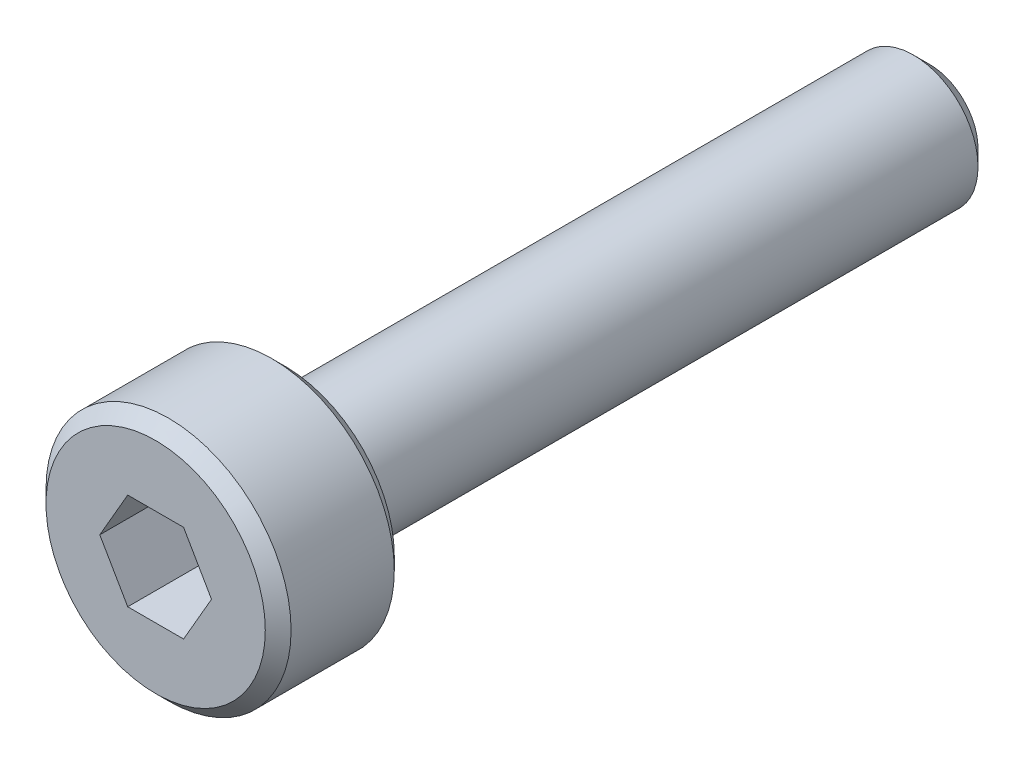
ISO-10303-21;
HEADER;
FILE_DESCRIPTION(('STEP AP214'),'2;1');
FILE_NAME('part.step','',(''),(''),'','','');
FILE_SCHEMA(('AUTOMOTIVE_DESIGN { 1 0 10303 214 1 1 1 1 }'));
ENDSEC;
DATA;
#1=APPLICATION_CONTEXT('core data for automotive mechanical design processes');
#2=APPLICATION_PROTOCOL_DEFINITION('international standard','automotive_design',2000,#1);
#3=PRODUCT_CONTEXT('',#1,'mechanical');
#4=PRODUCT('Part','Part','',(#3));
#5=PRODUCT_RELATED_PRODUCT_CATEGORY('part','',(#4));
#6=PRODUCT_DEFINITION_FORMATION('','',#4);
#7=PRODUCT_DEFINITION_CONTEXT('part definition',#1,'design');
#8=PRODUCT_DEFINITION('design','',#6,#7);
#9=PRODUCT_DEFINITION_SHAPE('','',#8);
#10=(LENGTH_UNIT() NAMED_UNIT(*) SI_UNIT(.MILLI.,.METRE.));
#11=(NAMED_UNIT(*) PLANE_ANGLE_UNIT() SI_UNIT($,.RADIAN.));
#12=(NAMED_UNIT(*) SI_UNIT($,.STERADIAN.) SOLID_ANGLE_UNIT());
#13=UNCERTAINTY_MEASURE_WITH_UNIT(LENGTH_MEASURE(1.E-05),#10,'distance_accuracy_value','');
#14=(GEOMETRIC_REPRESENTATION_CONTEXT(3) GLOBAL_UNCERTAINTY_ASSIGNED_CONTEXT((#13)) GLOBAL_UNIT_ASSIGNED_CONTEXT((#10,
#11,#12)) REPRESENTATION_CONTEXT('',''));
#15=CARTESIAN_POINT('',(0.,0.,0.));
#16=DIRECTION('',(0.,0.,1.));
#17=DIRECTION('',(1.,0.,0.));
#18=AXIS2_PLACEMENT_3D('',#15,#16,#17);
#19=CARTESIAN_POINT('',(0.,0.,0.));
#20=DIRECTION('',(0.,0.,1.));
#21=DIRECTION('',(1.,0.,0.));
#22=AXIS2_PLACEMENT_3D('',#19,#20,#21);
#23=PLANE('',#22);
#24=DIRECTION('',(0.499999999999999,0.866025403784439,0.));
#25=VECTOR('',#24,1.);
#26=CARTESIAN_POINT('',(0.433012701892219,-0.750000000000001,0.));
#27=LINE('',#26,#25);
#28=CARTESIAN_POINT('',(0.433012701892219,-0.750000000000001,0.));
#29=VERTEX_POINT('',#28);
#30=CARTESIAN_POINT('',(0.866025403784439,0.,0.));
#31=VERTEX_POINT('',#30);
#32=EDGE_CURVE('E45',#29,#31,#27,.T.);
#33=ORIENTED_EDGE('',*,*,#32,.F.);
#34=DIRECTION('',(1.,0.,0.));
#35=VECTOR('',#34,1.);
#36=CARTESIAN_POINT('',(-0.433012701892219,-0.750000000000001,0.));
#37=LINE('',#36,#35);
#38=CARTESIAN_POINT('',(-0.433012701892219,-0.750000000000001,0.));
#39=VERTEX_POINT('',#38);
#40=EDGE_CURVE('E128',#39,#29,#37,.T.);
#41=ORIENTED_EDGE('',*,*,#40,.F.);
#42=DIRECTION('',(0.5,-0.866025403784439,0.));
#43=VECTOR('',#42,1.);
#44=CARTESIAN_POINT('',(-0.866025403784439,0.,0.));
#45=LINE('',#44,#43);
#46=CARTESIAN_POINT('',(-0.866025403784439,0.,0.));
#47=VERTEX_POINT('',#46);
#48=EDGE_CURVE('E126',#47,#39,#45,.T.);
#49=ORIENTED_EDGE('',*,*,#48,.F.);
#50=DIRECTION('',(-0.5,-0.866025403784439,0.));
#51=VECTOR('',#50,1.);
#52=CARTESIAN_POINT('',(-0.43301270189222,0.75,0.));
#53=LINE('',#52,#51);
#54=CARTESIAN_POINT('',(-0.43301270189222,0.75,0.));
#55=VERTEX_POINT('',#54);
#56=EDGE_CURVE('E93',#55,#47,#53,.T.);
#57=ORIENTED_EDGE('',*,*,#56,.F.);
#58=DIRECTION('',(-1.,0.,0.));
#59=VECTOR('',#58,1.);
#60=CARTESIAN_POINT('',(0.433012701892219,0.75,0.));
#61=LINE('',#60,#59);
#62=CARTESIAN_POINT('',(0.433012701892219,0.75,0.));
#63=VERTEX_POINT('',#62);
#64=EDGE_CURVE('E122',#63,#55,#61,.T.);
#65=ORIENTED_EDGE('',*,*,#64,.F.);
#66=DIRECTION('',(-0.5,0.866025403784439,0.));
#67=VECTOR('',#66,1.);
#68=CARTESIAN_POINT('',(0.866025403784439,0.,0.));
#69=LINE('',#68,#67);
#70=EDGE_CURVE('E119',#31,#63,#69,.T.);
#71=ORIENTED_EDGE('',*,*,#70,.F.);
#72=EDGE_LOOP('',(#33,#41,#49,#57,#65,#71));
#73=FACE_BOUND('',#72,.T.);
#74=CARTESIAN_POINT('',(0.,0.,0.));
#75=DIRECTION('',(0.,0.,1.));
#76=DIRECTION('',(1.,0.,0.));
#77=AXIS2_PLACEMENT_3D('',#74,#75,#76);
#78=CIRCLE('',#77,1.7);
#79=CARTESIAN_POINT('',(1.7,0.,0.));
#80=VERTEX_POINT('',#79);
#81=EDGE_CURVE('E11',#80,#80,#78,.T.);
#82=ORIENTED_EDGE('',*,*,#81,.T.);
#83=EDGE_LOOP('',(#82));
#84=FACE_BOUND('',#83,.T.);
#85=ADVANCED_FACE('F31',(#73,#84),#23,.T.);
#86=CARTESIAN_POINT('',(0.,0.,0.));
#87=DIRECTION('',(0.,0.,-1.));
#88=DIRECTION('',(-1.,0.,0.));
#89=AXIS2_PLACEMENT_3D('',#86,#87,#88);
#90=CONICAL_SURFACE('',#89,1.7,0.785398163397446);
#91=CARTESIAN_POINT('',(0.,0.,-0.2));
#92=DIRECTION('',(0.,0.,1.));
#93=DIRECTION('',(1.,0.,0.));
#94=AXIS2_PLACEMENT_3D('',#91,#92,#93);
#95=CIRCLE('',#94,1.9);
#96=CARTESIAN_POINT('',(1.9,0.,-0.2));
#97=VERTEX_POINT('',#96);
#98=EDGE_CURVE('E38',#97,#97,#95,.T.);
#99=ORIENTED_EDGE('',*,*,#98,.T.);
#100=EDGE_LOOP('',(#99));
#101=FACE_BOUND('',#100,.T.);
#102=ORIENTED_EDGE('',*,*,#81,.F.);
#103=EDGE_LOOP('',(#102));
#104=FACE_BOUND('',#103,.T.);
#105=ADVANCED_FACE('F154',(#101,#104),#90,.T.);
#106=CARTESIAN_POINT('',(0.,0.,0.));
#107=DIRECTION('',(0.,0.,1.));
#108=DIRECTION('',(1.,0.,0.));
#109=AXIS2_PLACEMENT_3D('',#106,#107,#108);
#110=CYLINDRICAL_SURFACE('',#109,1.9);
#111=CARTESIAN_POINT('',(0.,0.,-1.8));
#112=DIRECTION('',(0.,0.,1.));
#113=DIRECTION('',(1.,0.,0.));
#114=AXIS2_PLACEMENT_3D('',#111,#112,#113);
#115=CIRCLE('',#114,1.9);
#116=CARTESIAN_POINT('',(1.9,0.,-1.8));
#117=VERTEX_POINT('',#116);
#118=EDGE_CURVE('E149',#117,#117,#115,.T.);
#119=ORIENTED_EDGE('',*,*,#118,.T.);
#120=EDGE_LOOP('',(#119));
#121=FACE_BOUND('',#120,.T.);
#122=ORIENTED_EDGE('',*,*,#98,.F.);
#123=EDGE_LOOP('',(#122));
#124=FACE_BOUND('',#123,.T.);
#125=ADVANCED_FACE('F157',(#121,#124),#110,.T.);
#126=CARTESIAN_POINT('',(0.,0.,-1.8));
#127=DIRECTION('',(0.,0.,1.));
#128=DIRECTION('',(1.,0.,0.));
#129=AXIS2_PLACEMENT_3D('',#126,#127,#128);
#130=CONICAL_SURFACE('',#129,1.9,0.785398163397447);
#131=CARTESIAN_POINT('',(0.,0.,-2.));
#132=DIRECTION('',(0.,0.,1.));
#133=DIRECTION('',(1.,0.,0.));
#134=AXIS2_PLACEMENT_3D('',#131,#132,#133);
#135=CIRCLE('',#134,1.7);
#136=CARTESIAN_POINT('',(1.7,0.,-2.));
#137=VERTEX_POINT('',#136);
#138=EDGE_CURVE('E146',#137,#137,#135,.T.);
#139=ORIENTED_EDGE('',*,*,#138,.T.);
#140=EDGE_LOOP('',(#139));
#141=FACE_BOUND('',#140,.T.);
#142=ORIENTED_EDGE('',*,*,#118,.F.);
#143=EDGE_LOOP('',(#142));
#144=FACE_BOUND('',#143,.T.);
#145=ADVANCED_FACE('F159',(#141,#144),#130,.T.);
#146=CARTESIAN_POINT('',(1.7,0.,-2.));
#147=DIRECTION('',(0.,0.,-1.));
#148=DIRECTION('',(-1.,0.,0.));
#149=AXIS2_PLACEMENT_3D('',#146,#147,#148);
#150=PLANE('',#149);
#151=CARTESIAN_POINT('',(0.,0.,-2.));
#152=DIRECTION('',(0.,0.,1.));
#153=DIRECTION('',(1.,0.,0.));
#154=AXIS2_PLACEMENT_3D('',#151,#152,#153);
#155=CIRCLE('',#154,1.);
#156=CARTESIAN_POINT('',(1.,0.,-2.));
#157=VERTEX_POINT('',#156);
#158=EDGE_CURVE('E143',#157,#157,#155,.T.);
#159=ORIENTED_EDGE('',*,*,#158,.T.);
#160=EDGE_LOOP('',(#159));
#161=FACE_BOUND('',#160,.T.);
#162=ORIENTED_EDGE('',*,*,#138,.F.);
#163=EDGE_LOOP('',(#162));
#164=FACE_BOUND('',#163,.T.);
#165=ADVANCED_FACE('F166',(#161,#164),#150,.T.);
#166=CARTESIAN_POINT('',(0.,0.,0.));
#167=DIRECTION('',(0.,0.,1.));
#168=DIRECTION('',(1.,0.,0.));
#169=AXIS2_PLACEMENT_3D('',#166,#167,#168);
#170=CYLINDRICAL_SURFACE('',#169,1.);
#171=CARTESIAN_POINT('',(0.,0.,-11.75));
#172=DIRECTION('',(0.,0.,1.));
#173=DIRECTION('',(1.,0.,0.));
#174=AXIS2_PLACEMENT_3D('',#171,#172,#173);
#175=CIRCLE('',#174,1.);
#176=CARTESIAN_POINT('',(1.,0.,-11.75));
#177=VERTEX_POINT('',#176);
#178=EDGE_CURVE('E140',#177,#177,#175,.T.);
#179=ORIENTED_EDGE('',*,*,#178,.T.);
#180=EDGE_LOOP('',(#179));
#181=FACE_BOUND('',#180,.T.);
#182=ORIENTED_EDGE('',*,*,#158,.F.);
#183=EDGE_LOOP('',(#182));
#184=FACE_BOUND('',#183,.T.);
#185=ADVANCED_FACE('F199',(#181,#184),#170,.T.);
#186=CARTESIAN_POINT('',(0.,0.,-11.75));
#187=DIRECTION('',(0.,0.,1.));
#188=DIRECTION('',(1.,0.,0.));
#189=AXIS2_PLACEMENT_3D('',#186,#187,#188);
#190=CONICAL_SURFACE('',#189,1.,0.785398163397451);
#191=CARTESIAN_POINT('',(0.,0.,-12.));
#192=DIRECTION('',(0.,0.,1.));
#193=DIRECTION('',(1.,0.,0.));
#194=AXIS2_PLACEMENT_3D('',#191,#192,#193);
#195=CIRCLE('',#194,0.75);
#196=CARTESIAN_POINT('',(0.75,0.,-12.));
#197=VERTEX_POINT('',#196);
#198=EDGE_CURVE('E132',#197,#197,#195,.T.);
#199=ORIENTED_EDGE('',*,*,#198,.T.);
#200=EDGE_LOOP('',(#199));
#201=FACE_BOUND('',#200,.T.);
#202=ORIENTED_EDGE('',*,*,#178,.F.);
#203=EDGE_LOOP('',(#202));
#204=FACE_BOUND('',#203,.T.);
#205=ADVANCED_FACE('F191',(#201,#204),#190,.T.);
#206=CARTESIAN_POINT('',(0.75,0.,-12.));
#207=DIRECTION('',(0.,0.,-1.));
#208=DIRECTION('',(-1.,0.,0.));
#209=AXIS2_PLACEMENT_3D('',#206,#207,#208);
#210=PLANE('',#209);
#211=ORIENTED_EDGE('',*,*,#198,.F.);
#212=EDGE_LOOP('',(#211));
#213=FACE_BOUND('',#212,.T.);
#214=ADVANCED_FACE('F184',(#213),#210,.T.);
#215=CARTESIAN_POINT('',(0.433012701892219,-0.750000000000001,-1.8));
#216=DIRECTION('',(0.866025403784439,-0.499999999999999,0.));
#217=DIRECTION('',(0.499999999999999,0.866025403784439,0.));
#218=AXIS2_PLACEMENT_3D('',#215,#216,#217);
#219=PLANE('',#218);
#220=ORIENTED_EDGE('',*,*,#32,.T.);
#221=DIRECTION('',(0.,0.,1.));
#222=VECTOR('',#221,1.);
#223=CARTESIAN_POINT('',(0.866025403784439,0.,-1.8));
#224=LINE('',#223,#222);
#225=CARTESIAN_POINT('',(0.866025403784439,0.,-1.8));
#226=VERTEX_POINT('',#225);
#227=EDGE_CURVE('E75',#226,#31,#224,.T.);
#228=ORIENTED_EDGE('',*,*,#227,.F.);
#229=DIRECTION('',(0.499999999999999,0.866025403784439,0.));
#230=VECTOR('',#229,1.);
#231=CARTESIAN_POINT('',(0.433012701892219,-0.750000000000001,-1.8));
#232=LINE('',#231,#230);
#233=CARTESIAN_POINT('',(0.433012701892219,-0.750000000000001,-1.8));
#234=VERTEX_POINT('',#233);
#235=EDGE_CURVE('E130',#234,#226,#232,.T.);
#236=ORIENTED_EDGE('',*,*,#235,.F.);
#237=DIRECTION('',(0.,0.,1.));
#238=VECTOR('',#237,1.);
#239=CARTESIAN_POINT('',(0.433012701892219,-0.750000000000001,-1.8));
#240=LINE('',#239,#238);
#241=EDGE_CURVE('E53',#234,#29,#240,.T.);
#242=ORIENTED_EDGE('',*,*,#241,.T.);
#243=EDGE_LOOP('',(#220,#228,#236,#242));
#244=FACE_BOUND('',#243,.T.);
#245=ADVANCED_FACE('F181',(#244),#219,.F.);
#246=CARTESIAN_POINT('',(-0.433012701892219,-0.750000000000001,-1.8));
#247=DIRECTION('',(0.,-1.,0.));
#248=DIRECTION('',(0.,0.,-1.));
#249=AXIS2_PLACEMENT_3D('',#246,#247,#248);
#250=PLANE('',#249);
#251=ORIENTED_EDGE('',*,*,#40,.T.);
#252=ORIENTED_EDGE('',*,*,#241,.F.);
#253=DIRECTION('',(1.,0.,0.));
#254=VECTOR('',#253,1.);
#255=CARTESIAN_POINT('',(-0.433012701892219,-0.750000000000001,-1.8));
#256=LINE('',#255,#254);
#257=CARTESIAN_POINT('',(-0.433012701892219,-0.750000000000001,-1.8));
#258=VERTEX_POINT('',#257);
#259=EDGE_CURVE('E105',#258,#234,#256,.T.);
#260=ORIENTED_EDGE('',*,*,#259,.F.);
#261=DIRECTION('',(0.,0.,1.));
#262=VECTOR('',#261,1.);
#263=CARTESIAN_POINT('',(-0.433012701892219,-0.750000000000001,-1.8));
#264=LINE('',#263,#262);
#265=EDGE_CURVE('E97',#258,#39,#264,.T.);
#266=ORIENTED_EDGE('',*,*,#265,.T.);
#267=EDGE_LOOP('',(#251,#252,#260,#266));
#268=FACE_BOUND('',#267,.T.);
#269=ADVANCED_FACE('F183',(#268),#250,.F.);
#270=CARTESIAN_POINT('',(-0.866025403784439,0.,-1.8));
#271=DIRECTION('',(-0.866025403784438,-0.5,0.));
#272=DIRECTION('',(0.5,-0.866025403784439,0.));
#273=AXIS2_PLACEMENT_3D('',#270,#271,#272);
#274=PLANE('',#273);
#275=ORIENTED_EDGE('',*,*,#48,.T.);
#276=ORIENTED_EDGE('',*,*,#265,.F.);
#277=DIRECTION('',(0.5,-0.866025403784439,0.));
#278=VECTOR('',#277,1.);
#279=CARTESIAN_POINT('',(-0.866025403784439,0.,-1.8));
#280=LINE('',#279,#278);
#281=CARTESIAN_POINT('',(-0.866025403784439,0.,-1.8));
#282=VERTEX_POINT('',#281);
#283=EDGE_CURVE('E101',#282,#258,#280,.T.);
#284=ORIENTED_EDGE('',*,*,#283,.F.);
#285=DIRECTION('',(0.,0.,1.));
#286=VECTOR('',#285,1.);
#287=CARTESIAN_POINT('',(-0.866025403784439,0.,-1.8));
#288=LINE('',#287,#286);
#289=EDGE_CURVE('E86',#282,#47,#288,.T.);
#290=ORIENTED_EDGE('',*,*,#289,.T.);
#291=EDGE_LOOP('',(#275,#276,#284,#290));
#292=FACE_BOUND('',#291,.T.);
#293=ADVANCED_FACE('F102',(#292),#274,.F.);
#294=CARTESIAN_POINT('',(-0.43301270189222,0.75,-1.8));
#295=DIRECTION('',(-0.866025403784439,0.5,0.));
#296=DIRECTION('',(-0.5,-0.866025403784439,0.));
#297=AXIS2_PLACEMENT_3D('',#294,#295,#296);
#298=PLANE('',#297);
#299=ORIENTED_EDGE('',*,*,#56,.T.);
#300=ORIENTED_EDGE('',*,*,#289,.F.);
#301=DIRECTION('',(-0.5,-0.866025403784439,0.));
#302=VECTOR('',#301,1.);
#303=CARTESIAN_POINT('',(-0.43301270189222,0.75,-1.8));
#304=LINE('',#303,#302);
#305=CARTESIAN_POINT('',(-0.43301270189222,0.75,-1.8));
#306=VERTEX_POINT('',#305);
#307=EDGE_CURVE('E90',#306,#282,#304,.T.);
#308=ORIENTED_EDGE('',*,*,#307,.F.);
#309=DIRECTION('',(0.,0.,1.));
#310=VECTOR('',#309,1.);
#311=CARTESIAN_POINT('',(-0.43301270189222,0.75,-1.8));
#312=LINE('',#311,#310);
#313=EDGE_CURVE('E98',#306,#55,#312,.T.);
#314=ORIENTED_EDGE('',*,*,#313,.T.);
#315=EDGE_LOOP('',(#299,#300,#308,#314));
#316=FACE_BOUND('',#315,.T.);
#317=ADVANCED_FACE('F88',(#316),#298,.F.);
#318=CARTESIAN_POINT('',(0.433012701892219,0.75,-1.8));
#319=DIRECTION('',(0.,1.,0.));
#320=DIRECTION('',(0.,0.,1.));
#321=AXIS2_PLACEMENT_3D('',#318,#319,#320);
#322=PLANE('',#321);
#323=ORIENTED_EDGE('',*,*,#64,.T.);
#324=ORIENTED_EDGE('',*,*,#313,.F.);
#325=DIRECTION('',(-1.,0.,0.));
#326=VECTOR('',#325,1.);
#327=CARTESIAN_POINT('',(0.433012701892219,0.75,-1.8));
#328=LINE('',#327,#326);
#329=CARTESIAN_POINT('',(0.433012701892219,0.75,-1.8));
#330=VERTEX_POINT('',#329);
#331=EDGE_CURVE('E111',#330,#306,#328,.T.);
#332=ORIENTED_EDGE('',*,*,#331,.F.);
#333=DIRECTION('',(0.,0.,1.));
#334=VECTOR('',#333,1.);
#335=CARTESIAN_POINT('',(0.433012701892219,0.75,-1.8));
#336=LINE('',#335,#334);
#337=EDGE_CURVE('E135',#330,#63,#336,.T.);
#338=ORIENTED_EDGE('',*,*,#337,.T.);
#339=EDGE_LOOP('',(#323,#324,#332,#338));
#340=FACE_BOUND('',#339,.T.);
#341=ADVANCED_FACE('F260',(#340),#322,.F.);
#342=CARTESIAN_POINT('',(0.866025403784439,0.,-1.8));
#343=DIRECTION('',(0.866025403784438,0.5,0.));
#344=DIRECTION('',(-0.5,0.866025403784439,0.));
#345=AXIS2_PLACEMENT_3D('',#342,#343,#344);
#346=PLANE('',#345);
#347=ORIENTED_EDGE('',*,*,#70,.T.);
#348=ORIENTED_EDGE('',*,*,#337,.F.);
#349=DIRECTION('',(-0.5,0.866025403784439,0.));
#350=VECTOR('',#349,1.);
#351=CARTESIAN_POINT('',(0.866025403784439,0.,-1.8));
#352=LINE('',#351,#350);
#353=EDGE_CURVE('E113',#226,#330,#352,.T.);
#354=ORIENTED_EDGE('',*,*,#353,.F.);
#355=ORIENTED_EDGE('',*,*,#227,.T.);
#356=EDGE_LOOP('',(#347,#348,#354,#355));
#357=FACE_BOUND('',#356,.T.);
#358=ADVANCED_FACE('F179',(#357),#346,.F.);
#359=CARTESIAN_POINT('',(0.866025403784439,0.,-1.8));
#360=DIRECTION('',(0.,0.,1.));
#361=DIRECTION('',(1.,0.,0.));
#362=AXIS2_PLACEMENT_3D('',#359,#360,#361);
#363=PLANE('',#362);
#364=ORIENTED_EDGE('',*,*,#235,.T.);
#365=ORIENTED_EDGE('',*,*,#353,.T.);
#366=ORIENTED_EDGE('',*,*,#331,.T.);
#367=ORIENTED_EDGE('',*,*,#307,.T.);
#368=ORIENTED_EDGE('',*,*,#283,.T.);
#369=ORIENTED_EDGE('',*,*,#259,.T.);
#370=EDGE_LOOP('',(#364,#365,#366,#367,#368,#369));
#371=FACE_BOUND('',#370,.T.);
#372=ADVANCED_FACE('F108',(#371),#363,.T.);
#373=CLOSED_SHELL('',(#85,#105,#125,#145,#165,#185,#205,#214,#245,#269,#293,#317,#341,#358,#372));
#374=MANIFOLD_SOLID_BREP('B2',#373);
#375=ADVANCED_BREP_SHAPE_REPRESENTATION('',(#18,#374),#14);
#376=SHAPE_DEFINITION_REPRESENTATION(#9,#375);
ENDSEC;
END-ISO-10303-21;
